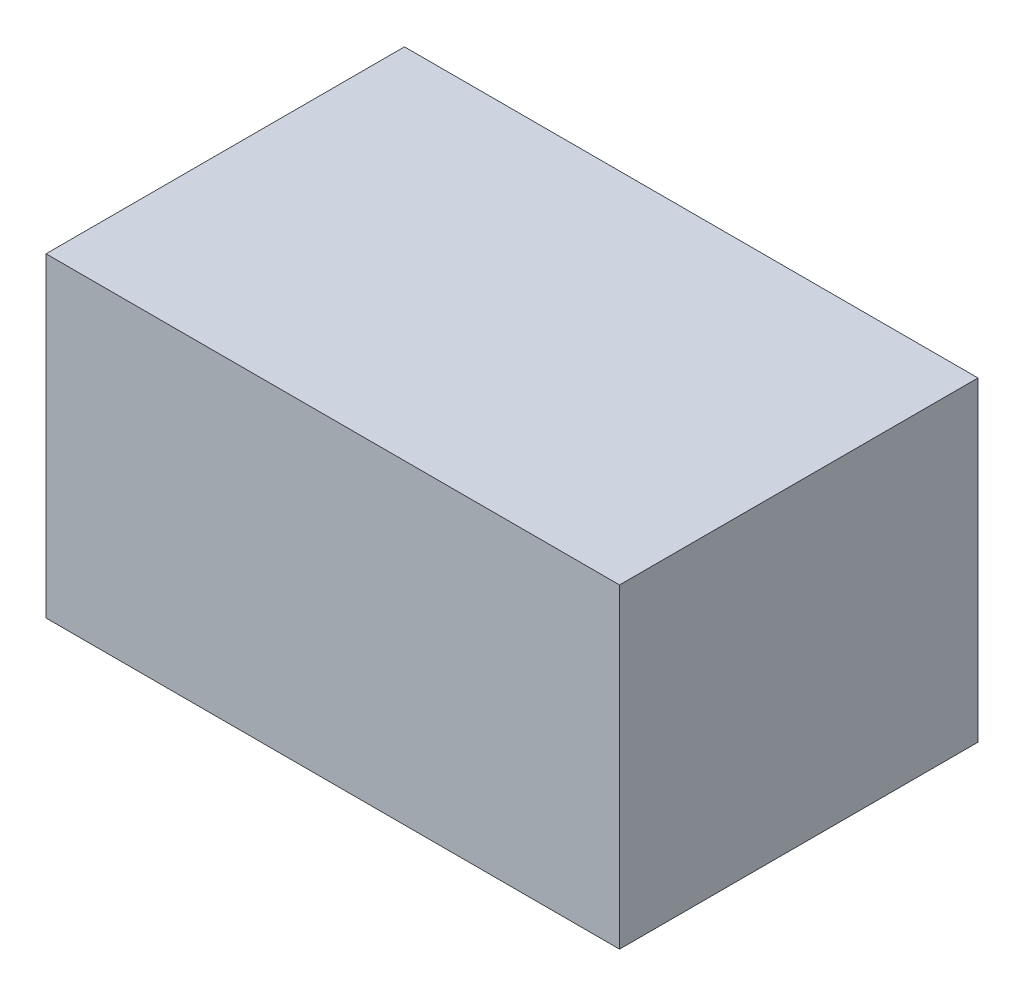
ISO-10303-21;
HEADER;
FILE_DESCRIPTION(('STEP AP214'),'2;1');
FILE_NAME('part.step','',(''),(''),'','','');
FILE_SCHEMA(('AUTOMOTIVE_DESIGN { 1 0 10303 214 1 1 1 1 }'));
ENDSEC;
DATA;
#1=APPLICATION_CONTEXT('core data for automotive mechanical design processes');
#2=APPLICATION_PROTOCOL_DEFINITION('international standard','automotive_design',2000,#1);
#3=PRODUCT_CONTEXT('',#1,'mechanical');
#4=PRODUCT('Part','Part','',(#3));
#5=PRODUCT_RELATED_PRODUCT_CATEGORY('part','',(#4));
#6=PRODUCT_DEFINITION_FORMATION('','',#4);
#7=PRODUCT_DEFINITION_CONTEXT('part definition',#1,'design');
#8=PRODUCT_DEFINITION('design','',#6,#7);
#9=PRODUCT_DEFINITION_SHAPE('','',#8);
#10=(LENGTH_UNIT() NAMED_UNIT(*) SI_UNIT(.MILLI.,.METRE.));
#11=(NAMED_UNIT(*) PLANE_ANGLE_UNIT() SI_UNIT($,.RADIAN.));
#12=(NAMED_UNIT(*) SI_UNIT($,.STERADIAN.) SOLID_ANGLE_UNIT());
#13=UNCERTAINTY_MEASURE_WITH_UNIT(LENGTH_MEASURE(1.E-05),#10,'distance_accuracy_value','');
#14=(GEOMETRIC_REPRESENTATION_CONTEXT(3) GLOBAL_UNCERTAINTY_ASSIGNED_CONTEXT((#13)) GLOBAL_UNIT_ASSIGNED_CONTEXT((#10,
#11,#12)) REPRESENTATION_CONTEXT('',''));
#15=CARTESIAN_POINT('',(0.,0.,0.));
#16=DIRECTION('',(0.,0.,1.));
#17=DIRECTION('',(1.,0.,0.));
#18=AXIS2_PLACEMENT_3D('',#15,#16,#17);
#19=CARTESIAN_POINT('',(12.165,1.57,2.7));
#20=DIRECTION('',(0.,1.,0.));
#21=DIRECTION('',(0.,0.,1.));
#22=AXIS2_PLACEMENT_3D('',#19,#20,#21);
#23=PLANE('',#22);
#24=DIRECTION('',(0.,0.,1.));
#25=VECTOR('',#24,1.);
#26=CARTESIAN_POINT('',(10.165,1.57,1.45));
#27=LINE('',#26,#25);
#28=CARTESIAN_POINT('',(10.165,1.57,1.45));
#29=VERTEX_POINT('',#28);
#30=CARTESIAN_POINT('',(10.165,1.57,3.95));
#31=VERTEX_POINT('',#30);
#32=EDGE_CURVE('E79',#29,#31,#27,.T.);
#33=ORIENTED_EDGE('',*,*,#32,.F.);
#34=DIRECTION('',(-1.,0.,0.));
#35=VECTOR('',#34,1.);
#36=CARTESIAN_POINT('',(14.165,1.57,1.45));
#37=LINE('',#36,#35);
#38=CARTESIAN_POINT('',(14.165,1.57,1.45));
#39=VERTEX_POINT('',#38);
#40=EDGE_CURVE('E55',#39,#29,#37,.T.);
#41=ORIENTED_EDGE('',*,*,#40,.F.);
#42=DIRECTION('',(0.,0.,-1.));
#43=VECTOR('',#42,1.);
#44=CARTESIAN_POINT('',(14.165,1.57,3.95));
#45=LINE('',#44,#43);
#46=CARTESIAN_POINT('',(14.165,1.57,3.95));
#47=VERTEX_POINT('',#46);
#48=EDGE_CURVE('E57',#47,#39,#45,.T.);
#49=ORIENTED_EDGE('',*,*,#48,.F.);
#50=DIRECTION('',(1.,0.,0.));
#51=VECTOR('',#50,1.);
#52=CARTESIAN_POINT('',(10.165,1.57,3.95));
#53=LINE('',#52,#51);
#54=EDGE_CURVE('E20',#31,#47,#53,.T.);
#55=ORIENTED_EDGE('',*,*,#54,.F.);
#56=EDGE_LOOP('',(#33,#41,#49,#55));
#57=FACE_BOUND('',#56,.T.);
#58=ADVANCED_FACE('F17',(#57),#23,.F.);
#59=CARTESIAN_POINT('',(10.165,1.57,3.95));
#60=DIRECTION('',(0.,0.,1.));
#61=DIRECTION('',(1.,0.,0.));
#62=AXIS2_PLACEMENT_3D('',#59,#60,#61);
#63=PLANE('',#62);
#64=DIRECTION('',(1.,0.,0.));
#65=VECTOR('',#64,1.);
#66=CARTESIAN_POINT('',(12.165,3.77,3.95));
#67=LINE('',#66,#65);
#68=CARTESIAN_POINT('',(10.165,3.77,3.95));
#69=VERTEX_POINT('',#68);
#70=CARTESIAN_POINT('',(14.165,3.77,3.95));
#71=VERTEX_POINT('',#70);
#72=EDGE_CURVE('E83',#69,#71,#67,.T.);
#73=ORIENTED_EDGE('',*,*,#72,.F.);
#74=DIRECTION('',(0.,1.,0.));
#75=VECTOR('',#74,1.);
#76=CARTESIAN_POINT('',(10.165,1.57,3.95));
#77=LINE('',#76,#75);
#78=EDGE_CURVE('E68',#31,#69,#77,.T.);
#79=ORIENTED_EDGE('',*,*,#78,.F.);
#80=ORIENTED_EDGE('',*,*,#54,.T.);
#81=DIRECTION('',(0.,1.,0.));
#82=VECTOR('',#81,1.);
#83=CARTESIAN_POINT('',(14.165,1.57,3.95));
#84=LINE('',#83,#82);
#85=EDGE_CURVE('E63',#71,#47,#84,.F.);
#86=ORIENTED_EDGE('',*,*,#85,.F.);
#87=EDGE_LOOP('',(#73,#79,#80,#86));
#88=FACE_BOUND('',#87,.T.);
#89=ADVANCED_FACE('F65',(#88),#63,.T.);
#90=CARTESIAN_POINT('',(14.165,1.57,3.95));
#91=DIRECTION('',(1.,0.,0.));
#92=DIRECTION('',(0.,0.,-1.));
#93=AXIS2_PLACEMENT_3D('',#90,#91,#92);
#94=PLANE('',#93);
#95=DIRECTION('',(0.,0.,1.));
#96=VECTOR('',#95,1.);
#97=CARTESIAN_POINT('',(14.165,3.77,2.7));
#98=LINE('',#97,#96);
#99=CARTESIAN_POINT('',(14.165,3.77,1.45));
#100=VERTEX_POINT('',#99);
#101=EDGE_CURVE('E72',#71,#100,#98,.F.);
#102=ORIENTED_EDGE('',*,*,#101,.F.);
#103=ORIENTED_EDGE('',*,*,#85,.T.);
#104=ORIENTED_EDGE('',*,*,#48,.T.);
#105=DIRECTION('',(0.,1.,0.));
#106=VECTOR('',#105,1.);
#107=CARTESIAN_POINT('',(14.165,1.57,1.45));
#108=LINE('',#107,#106);
#109=EDGE_CURVE('E75',#100,#39,#108,.F.);
#110=ORIENTED_EDGE('',*,*,#109,.F.);
#111=EDGE_LOOP('',(#102,#103,#104,#110));
#112=FACE_BOUND('',#111,.T.);
#113=ADVANCED_FACE('F70',(#112),#94,.T.);
#114=CARTESIAN_POINT('',(14.165,1.57,1.45));
#115=DIRECTION('',(0.,0.,-1.));
#116=DIRECTION('',(-1.,0.,0.));
#117=AXIS2_PLACEMENT_3D('',#114,#115,#116);
#118=PLANE('',#117);
#119=DIRECTION('',(1.,0.,0.));
#120=VECTOR('',#119,1.);
#121=CARTESIAN_POINT('',(12.165,3.77,1.45));
#122=LINE('',#121,#120);
#123=CARTESIAN_POINT('',(10.165,3.77,1.45));
#124=VERTEX_POINT('',#123);
#125=EDGE_CURVE('E26',#100,#124,#122,.F.);
#126=ORIENTED_EDGE('',*,*,#125,.F.);
#127=ORIENTED_EDGE('',*,*,#109,.T.);
#128=ORIENTED_EDGE('',*,*,#40,.T.);
#129=DIRECTION('',(0.,1.,0.));
#130=VECTOR('',#129,1.);
#131=CARTESIAN_POINT('',(10.165,1.57,1.45));
#132=LINE('',#131,#130);
#133=EDGE_CURVE('E35',#124,#29,#132,.F.);
#134=ORIENTED_EDGE('',*,*,#133,.F.);
#135=EDGE_LOOP('',(#126,#127,#128,#134));
#136=FACE_BOUND('',#135,.T.);
#137=ADVANCED_FACE('F89',(#136),#118,.T.);
#138=CARTESIAN_POINT('',(10.165,1.57,1.45));
#139=DIRECTION('',(-1.,0.,0.));
#140=DIRECTION('',(0.,0.,1.));
#141=AXIS2_PLACEMENT_3D('',#138,#139,#140);
#142=PLANE('',#141);
#143=DIRECTION('',(0.,0.,1.));
#144=VECTOR('',#143,1.);
#145=CARTESIAN_POINT('',(10.165,3.77,2.7));
#146=LINE('',#145,#144);
#147=EDGE_CURVE('E11',#124,#69,#146,.T.);
#148=ORIENTED_EDGE('',*,*,#147,.F.);
#149=ORIENTED_EDGE('',*,*,#133,.T.);
#150=ORIENTED_EDGE('',*,*,#32,.T.);
#151=ORIENTED_EDGE('',*,*,#78,.T.);
#152=EDGE_LOOP('',(#148,#149,#150,#151));
#153=FACE_BOUND('',#152,.T.);
#154=ADVANCED_FACE('F91',(#153),#142,.T.);
#155=CARTESIAN_POINT('',(12.165,3.77,2.7));
#156=DIRECTION('',(0.,1.,0.));
#157=DIRECTION('',(0.,0.,1.));
#158=AXIS2_PLACEMENT_3D('',#155,#156,#157);
#159=PLANE('',#158);
#160=ORIENTED_EDGE('',*,*,#125,.T.);
#161=ORIENTED_EDGE('',*,*,#147,.T.);
#162=ORIENTED_EDGE('',*,*,#72,.T.);
#163=ORIENTED_EDGE('',*,*,#101,.T.);
#164=EDGE_LOOP('',(#160,#161,#162,#163));
#165=FACE_BOUND('',#164,.T.);
#166=ADVANCED_FACE('F88',(#165),#159,.T.);
#167=CLOSED_SHELL('',(#58,#89,#113,#137,#154,#166));
#168=MANIFOLD_SOLID_BREP('B1',#167);
#169=ADVANCED_BREP_SHAPE_REPRESENTATION('',(#18,#168),#14);
#170=SHAPE_DEFINITION_REPRESENTATION(#9,#169);
ENDSEC;
END-ISO-10303-21;
